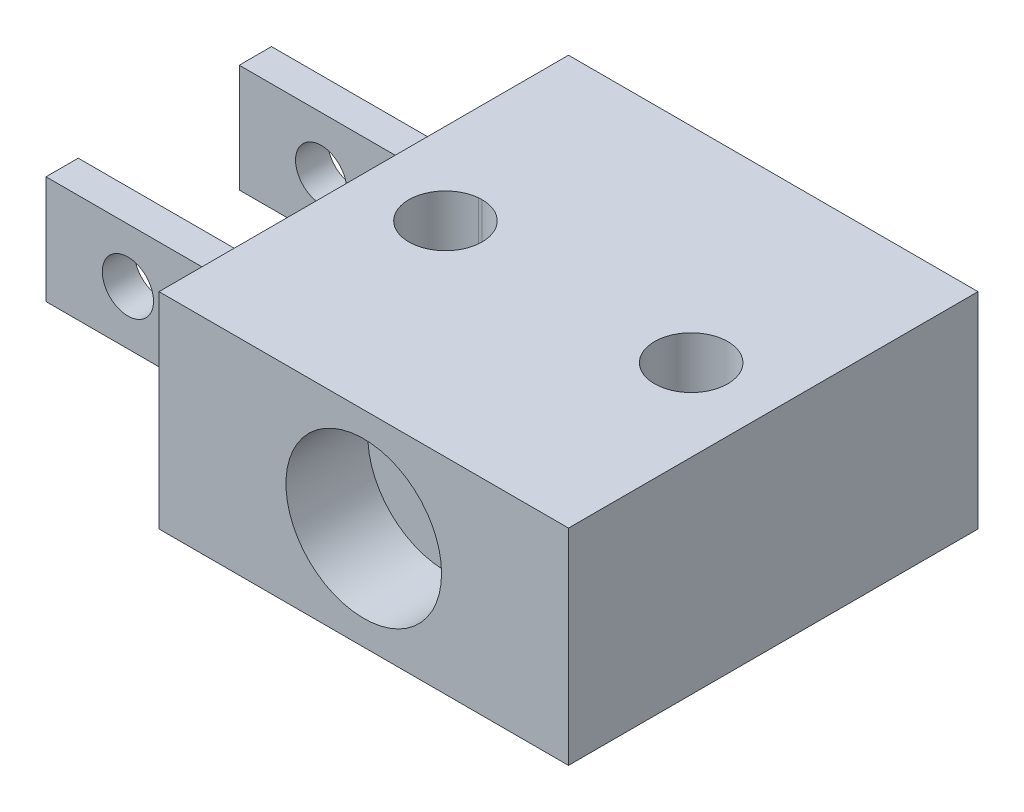
ISO-10303-21;
HEADER;
FILE_DESCRIPTION(('STEP AP214'),'2;1');
FILE_NAME('part.step','',(''),(''),'','','');
FILE_SCHEMA(('AUTOMOTIVE_DESIGN { 1 0 10303 214 1 1 1 1 }'));
ENDSEC;
DATA;
#1=APPLICATION_CONTEXT('core data for automotive mechanical design processes');
#2=APPLICATION_PROTOCOL_DEFINITION('international standard','automotive_design',2000,#1);
#3=PRODUCT_CONTEXT('',#1,'mechanical');
#4=PRODUCT('Part','Part','',(#3));
#5=PRODUCT_RELATED_PRODUCT_CATEGORY('part','',(#4));
#6=PRODUCT_DEFINITION_FORMATION('','',#4);
#7=PRODUCT_DEFINITION_CONTEXT('part definition',#1,'design');
#8=PRODUCT_DEFINITION('design','',#6,#7);
#9=PRODUCT_DEFINITION_SHAPE('','',#8);
#10=(LENGTH_UNIT() NAMED_UNIT(*) SI_UNIT(.MILLI.,.METRE.));
#11=(NAMED_UNIT(*) PLANE_ANGLE_UNIT() SI_UNIT($,.RADIAN.));
#12=(NAMED_UNIT(*) SI_UNIT($,.STERADIAN.) SOLID_ANGLE_UNIT());
#13=UNCERTAINTY_MEASURE_WITH_UNIT(LENGTH_MEASURE(1.E-05),#10,'distance_accuracy_value','');
#14=(GEOMETRIC_REPRESENTATION_CONTEXT(3) GLOBAL_UNCERTAINTY_ASSIGNED_CONTEXT((#13)) GLOBAL_UNIT_ASSIGNED_CONTEXT((#10,
#11,#12)) REPRESENTATION_CONTEXT('',''));
#15=CARTESIAN_POINT('',(0.,0.,0.));
#16=DIRECTION('',(0.,0.,1.));
#17=DIRECTION('',(1.,0.,0.));
#18=AXIS2_PLACEMENT_3D('',#15,#16,#17);
#19=CARTESIAN_POINT('',(-6.381876663172,-2.7686,-4.460010977484));
#20=DIRECTION('',(-1.,0.,0.));
#21=DIRECTION('',(0.,0.,1.));
#22=AXIS2_PLACEMENT_3D('',#19,#20,#21);
#23=PLANE('',#22);
#24=DIRECTION('',(0.,1.,0.));
#25=VECTOR('',#24,1.);
#26=CARTESIAN_POINT('',(-6.381876663172,-2.7686,8.239989022516));
#27=LINE('',#26,#25);
#28=CARTESIAN_POINT('',(-6.381876663172,-2.7686,8.239989022516));
#29=VERTEX_POINT('',#28);
#30=CARTESIAN_POINT('',(-6.381876663172,3.6068,8.239989022516));
#31=VERTEX_POINT('',#30);
#32=EDGE_CURVE('E299',#29,#31,#27,.T.);
#33=ORIENTED_EDGE('',*,*,#32,.T.);
#34=DIRECTION('',(0.,0.,1.));
#35=VECTOR('',#34,1.);
#36=CARTESIAN_POINT('',(-6.381876663172,3.6068,-4.460010977484));
#37=LINE('',#36,#35);
#38=CARTESIAN_POINT('',(-6.381876663172,3.6068,-4.460010977484));
#39=VERTEX_POINT('',#38);
#40=EDGE_CURVE('E276',#39,#31,#37,.T.);
#41=ORIENTED_EDGE('',*,*,#40,.F.);
#42=DIRECTION('',(0.,1.,0.));
#43=VECTOR('',#42,1.);
#44=CARTESIAN_POINT('',(-6.381876663172,-2.7686,-4.460010977484));
#45=LINE('',#44,#43);
#46=CARTESIAN_POINT('',(-6.381876663172,-2.7686,-4.460010977484));
#47=VERTEX_POINT('',#46);
#48=EDGE_CURVE('E11',#47,#39,#45,.T.);
#49=ORIENTED_EDGE('',*,*,#48,.F.);
#50=DIRECTION('',(0.,0.,1.));
#51=VECTOR('',#50,1.);
#52=CARTESIAN_POINT('',(-6.381876663172,-2.7686,-4.460010977484));
#53=LINE('',#52,#51);
#54=EDGE_CURVE('E288',#47,#29,#53,.T.);
#55=ORIENTED_EDGE('',*,*,#54,.T.);
#56=EDGE_LOOP('',(#33,#41,#49,#55));
#57=FACE_BOUND('',#56,.T.);
#58=DIRECTION('',(0.,0.,1.));
#59=VECTOR('',#58,1.);
#60=CARTESIAN_POINT('',(-6.381876663172,-1.258551646474,-1.598810977484));
#61=LINE('',#60,#59);
#62=CARTESIAN_POINT('',(-6.381876663172,-1.258551646474,-1.598810977484));
#63=VERTEX_POINT('',#62);
#64=CARTESIAN_POINT('',(-6.381876663172,-1.258551646474,-0.598810970884001));
#65=VERTEX_POINT('',#64);
#66=EDGE_CURVE('E261',#63,#65,#61,.T.);
#67=ORIENTED_EDGE('',*,*,#66,.F.);
#68=DIRECTION('',(0.,-1.,0.));
#69=VECTOR('',#68,1.);
#70=CARTESIAN_POINT('',(-6.381876663172,2.094248354542,-1.598810977484));
#71=LINE('',#70,#69);
#72=CARTESIAN_POINT('',(-6.381876663172,2.094248354542,-1.598810977484));
#73=VERTEX_POINT('',#72);
#74=EDGE_CURVE('E240',#73,#63,#71,.T.);
#75=ORIENTED_EDGE('',*,*,#74,.F.);
#76=DIRECTION('',(0.,0.,-1.));
#77=VECTOR('',#76,1.);
#78=CARTESIAN_POINT('',(-6.381876663172,2.094248354542,-1.598810977484));
#79=LINE('',#78,#77);
#80=CARTESIAN_POINT('',(-6.381876663172,2.094248354542,-0.598810970884));
#81=VERTEX_POINT('',#80);
#82=EDGE_CURVE('E252',#81,#73,#79,.T.);
#83=ORIENTED_EDGE('',*,*,#82,.F.);
#84=DIRECTION('',(0.,1.,0.));
#85=VECTOR('',#84,1.);
#86=CARTESIAN_POINT('',(-6.381876663172,2.094248354542,-0.598810970884001));
#87=LINE('',#86,#85);
#88=EDGE_CURVE('E263',#65,#81,#87,.T.);
#89=ORIENTED_EDGE('',*,*,#88,.F.);
#90=EDGE_LOOP('',(#67,#75,#83,#89));
#91=FACE_BOUND('',#90,.T.);
#92=DIRECTION('',(0.,0.,1.));
#93=VECTOR('',#92,1.);
#94=CARTESIAN_POINT('',(-6.381876663172,-1.258551646474,4.394789022516));
#95=LINE('',#94,#93);
#96=CARTESIAN_POINT('',(-6.381876663172,-1.258551646474,4.394789022516));
#97=VERTEX_POINT('',#96);
#98=CARTESIAN_POINT('',(-6.381876663172,-1.258551646474,5.394789029116));
#99=VERTEX_POINT('',#98);
#100=EDGE_CURVE('E235',#97,#99,#95,.T.);
#101=ORIENTED_EDGE('',*,*,#100,.F.);
#102=DIRECTION('',(0.,-1.,0.));
#103=VECTOR('',#102,1.);
#104=CARTESIAN_POINT('',(-6.381876663172,2.094248354542,4.394789022516));
#105=LINE('',#104,#103);
#106=CARTESIAN_POINT('',(-6.381876663172,2.094248354542,4.394789022516));
#107=VERTEX_POINT('',#106);
#108=EDGE_CURVE('E237',#107,#97,#105,.T.);
#109=ORIENTED_EDGE('',*,*,#108,.F.);
#110=DIRECTION('',(0.,0.,-1.));
#111=VECTOR('',#110,1.);
#112=CARTESIAN_POINT('',(-6.381876663172,2.094248354542,4.394789022516));
#113=LINE('',#112,#111);
#114=CARTESIAN_POINT('',(-6.381876663172,2.094248354542,5.394789029116));
#115=VERTEX_POINT('',#114);
#116=EDGE_CURVE('E229',#115,#107,#113,.T.);
#117=ORIENTED_EDGE('',*,*,#116,.F.);
#118=DIRECTION('',(0.,1.,0.));
#119=VECTOR('',#118,1.);
#120=CARTESIAN_POINT('',(-6.381876663172,2.094248354542,5.394789029116));
#121=LINE('',#120,#119);
#122=EDGE_CURVE('E231',#99,#115,#121,.T.);
#123=ORIENTED_EDGE('',*,*,#122,.F.);
#124=EDGE_LOOP('',(#101,#109,#117,#123));
#125=FACE_BOUND('',#124,.T.);
#126=ADVANCED_FACE('F41',(#57,#91,#125),#23,.T.);
#127=CARTESIAN_POINT('',(-6.381876663172,-2.7686,-4.460010977484));
#128=DIRECTION('',(0.,0.,-1.));
#129=DIRECTION('',(-1.,0.,0.));
#130=AXIS2_PLACEMENT_3D('',#127,#128,#129);
#131=PLANE('',#130);
#132=ORIENTED_EDGE('',*,*,#48,.T.);
#133=DIRECTION('',(-1.,0.,0.));
#134=VECTOR('',#133,1.);
#135=CARTESIAN_POINT('',(-6.381876663172,3.6068,-4.460010977484));
#136=LINE('',#135,#134);
#137=CARTESIAN_POINT('',(6.318123336828,3.6068,-4.460010977484));
#138=VERTEX_POINT('',#137);
#139=EDGE_CURVE('E285',#138,#39,#136,.T.);
#140=ORIENTED_EDGE('',*,*,#139,.F.);
#141=DIRECTION('',(0.,1.,0.));
#142=VECTOR('',#141,1.);
#143=CARTESIAN_POINT('',(6.318123336828,-2.7686,-4.460010977484));
#144=LINE('',#143,#142);
#145=CARTESIAN_POINT('',(6.318123336828,-2.7686,-4.460010977484));
#146=VERTEX_POINT('',#145);
#147=EDGE_CURVE('E51',#146,#138,#144,.T.);
#148=ORIENTED_EDGE('',*,*,#147,.F.);
#149=DIRECTION('',(-1.,0.,0.));
#150=VECTOR('',#149,1.);
#151=CARTESIAN_POINT('',(-6.381876663172,-2.7686,-4.460010977484));
#152=LINE('',#151,#150);
#153=EDGE_CURVE('E297',#146,#47,#152,.T.);
#154=ORIENTED_EDGE('',*,*,#153,.T.);
#155=EDGE_LOOP('',(#132,#140,#148,#154));
#156=FACE_BOUND('',#155,.T.);
#157=ADVANCED_FACE('F325',(#156),#131,.T.);
#158=CARTESIAN_POINT('',(6.318123336828,-2.7686,-4.460010977484));
#159=DIRECTION('',(1.,0.,0.));
#160=DIRECTION('',(0.,0.,-1.));
#161=AXIS2_PLACEMENT_3D('',#158,#159,#160);
#162=PLANE('',#161);
#163=ORIENTED_EDGE('',*,*,#147,.T.);
#164=DIRECTION('',(0.,0.,-1.));
#165=VECTOR('',#164,1.);
#166=CARTESIAN_POINT('',(6.318123336828,3.6068,-4.460010977484));
#167=LINE('',#166,#165);
#168=CARTESIAN_POINT('',(6.318123336828,3.6068,8.239989022516));
#169=VERTEX_POINT('',#168);
#170=EDGE_CURVE('E282',#169,#138,#167,.T.);
#171=ORIENTED_EDGE('',*,*,#170,.F.);
#172=DIRECTION('',(0.,1.,0.));
#173=VECTOR('',#172,1.);
#174=CARTESIAN_POINT('',(6.318123336828,-2.7686,8.239989022516));
#175=LINE('',#174,#173);
#176=CARTESIAN_POINT('',(6.318123336828,-2.7686,8.239989022516));
#177=VERTEX_POINT('',#176);
#178=EDGE_CURVE('E302',#177,#169,#175,.T.);
#179=ORIENTED_EDGE('',*,*,#178,.F.);
#180=DIRECTION('',(0.,0.,-1.));
#181=VECTOR('',#180,1.);
#182=CARTESIAN_POINT('',(6.318123336828,-2.7686,-4.460010977484));
#183=LINE('',#182,#181);
#184=EDGE_CURVE('E294',#177,#146,#183,.T.);
#185=ORIENTED_EDGE('',*,*,#184,.T.);
#186=EDGE_LOOP('',(#163,#171,#179,#185));
#187=FACE_BOUND('',#186,.T.);
#188=ADVANCED_FACE('F328',(#187),#162,.T.);
#189=CARTESIAN_POINT('',(-6.381876663172,-2.7686,8.239989022516));
#190=DIRECTION('',(0.,0.,1.));
#191=DIRECTION('',(1.,0.,0.));
#192=AXIS2_PLACEMENT_3D('',#189,#190,#191);
#193=PLANE('',#192);
#194=CARTESIAN_POINT('',(-0.031876663172,0.417848354034,8.239989022516));
#195=DIRECTION('',(0.,0.,1.));
#196=DIRECTION('',(1.,0.,0.));
#197=AXIS2_PLACEMENT_3D('',#194,#195,#196);
#198=CIRCLE('',#197,2.41300000135541);
#199=CARTESIAN_POINT('',(2.38112333818341,0.417848354034,8.239989022516));
#200=VERTEX_POINT('',#199);
#201=EDGE_CURVE('E196',#200,#200,#198,.T.);
#202=ORIENTED_EDGE('',*,*,#201,.F.);
#203=EDGE_LOOP('',(#202));
#204=FACE_BOUND('',#203,.T.);
#205=ORIENTED_EDGE('',*,*,#178,.T.);
#206=DIRECTION('',(1.,0.,0.));
#207=VECTOR('',#206,1.);
#208=CARTESIAN_POINT('',(-6.381876663172,3.6068,8.239989022516));
#209=LINE('',#208,#207);
#210=EDGE_CURVE('E279',#31,#169,#209,.T.);
#211=ORIENTED_EDGE('',*,*,#210,.F.);
#212=ORIENTED_EDGE('',*,*,#32,.F.);
#213=DIRECTION('',(1.,0.,0.));
#214=VECTOR('',#213,1.);
#215=CARTESIAN_POINT('',(-6.381876663172,-2.7686,8.239989022516));
#216=LINE('',#215,#214);
#217=EDGE_CURVE('E291',#29,#177,#216,.T.);
#218=ORIENTED_EDGE('',*,*,#217,.T.);
#219=EDGE_LOOP('',(#205,#211,#212,#218));
#220=FACE_BOUND('',#219,.T.);
#221=ADVANCED_FACE('F324',(#204,#220),#193,.T.);
#222=CARTESIAN_POINT('',(0.,-2.7686,0.));
#223=DIRECTION('',(0.,1.,0.));
#224=DIRECTION('',(0.,0.,1.));
#225=AXIS2_PLACEMENT_3D('',#222,#223,#224);
#226=PLANE('',#225);
#227=CARTESIAN_POINT('',(-3.95503730808412,-2.7686,0.765337315663838));
#228=CARTESIAN_POINT('',(-3.95424719922483,-2.7686,0.765263360718107));
#229=CARTESIAN_POINT('',(-3.91665064908767,-2.7686,0.761794886278313));
#230=CARTESIAN_POINT('',(-3.87886658892281,-2.7686,0.76073077382576));
#231=CARTESIAN_POINT('',(-3.841876663172,-2.7686,0.759689026579999));
#232=B_SPLINE_CURVE_WITH_KNOTS('',3,(#227,#228,#229,#230,#231),.UNSPECIFIED.,.F.,.F.,(4,1,4),
(0.96805009174726,0.968721605649112,1.),.UNSPECIFIED.);
#233=CARTESIAN_POINT('',(-3.95503730808412,-2.7686,0.765337315663838));
#234=VERTEX_POINT('',#233);
#235=CARTESIAN_POINT('',(-3.841876663172,-2.7686,0.759689023870666));
#236=VERTEX_POINT('',#235);
#237=EDGE_CURVE('E143',#234,#236,#232,.T.);
#238=ORIENTED_EDGE('',*,*,#237,.F.);
#239=CARTESIAN_POINT('',(-3.84187666310434,-2.7686,1.89607107011184));
#240=DIRECTION('',(0.,1.,0.));
#241=DIRECTION('',(0.,0.,1.));
#242=AXIS2_PLACEMENT_3D('',#239,#240,#241);
#243=CIRCLE('',#242,1.13638204624117);
#244=EDGE_CURVE('E59',#234,#236,#243,.T.);
#245=ORIENTED_EDGE('',*,*,#244,.T.);
#246=EDGE_LOOP('',(#238,#245));
#247=FACE_BOUND('',#246,.T.);
#248=CARTESIAN_POINT('',(3.77812333689566,-2.7686,1.89607107011184));
#249=DIRECTION('',(0.,1.,0.));
#250=DIRECTION('',(0.,0.,1.));
#251=AXIS2_PLACEMENT_3D('',#248,#249,#250);
#252=CIRCLE('',#251,1.13638204624117);
#253=CARTESIAN_POINT('',(3.77812333689566,-2.7686,3.03245311635301));
#254=VERTEX_POINT('',#253);
#255=EDGE_CURVE('E567',#254,#254,#252,.T.);
#256=ORIENTED_EDGE('',*,*,#255,.T.);
#257=EDGE_LOOP('',(#256));
#258=FACE_BOUND('',#257,.T.);
#259=ORIENTED_EDGE('',*,*,#54,.F.);
#260=ORIENTED_EDGE('',*,*,#153,.F.);
#261=ORIENTED_EDGE('',*,*,#184,.F.);
#262=ORIENTED_EDGE('',*,*,#217,.F.);
#263=EDGE_LOOP('',(#259,#260,#261,#262));
#264=FACE_BOUND('',#263,.T.);
#265=ADVANCED_FACE('F155',(#247,#258,#264),#226,.F.);
#266=CARTESIAN_POINT('',(0.,3.6068,0.));
#267=DIRECTION('',(0.,1.,0.));
#268=DIRECTION('',(0.,0.,1.));
#269=AXIS2_PLACEMENT_3D('',#266,#267,#268);
#270=PLANE('',#269);
#271=CARTESIAN_POINT('',(-3.84187666310434,3.6068,1.89607107011184));
#272=DIRECTION('',(0.,1.,0.));
#273=DIRECTION('',(0.,0.,1.));
#274=AXIS2_PLACEMENT_3D('',#271,#272,#273);
#275=CIRCLE('',#274,1.13638204624117);
#276=CARTESIAN_POINT('',(-3.95503730808408,3.6068,0.765337315664293));
#277=VERTEX_POINT('',#276);
#278=CARTESIAN_POINT('',(-3.841876663172,3.6068,0.759689026579999));
#279=VERTEX_POINT('',#278);
#280=EDGE_CURVE('E64',#277,#279,#275,.T.);
#281=ORIENTED_EDGE('',*,*,#280,.F.);
#282=CARTESIAN_POINT('',(-3.841876663172,3.6068,0.759689026579999));
#283=CARTESIAN_POINT('',(-3.87886658892281,3.6068,0.76073077382576));
#284=CARTESIAN_POINT('',(-3.91665064908767,3.6068,0.761794886278313));
#285=CARTESIAN_POINT('',(-3.95424719922483,3.6068,0.765263360718107));
#286=CARTESIAN_POINT('',(-3.95503730808412,3.6068,0.765337315663838));
#287=B_SPLINE_CURVE_WITH_KNOTS('',3,(#282,#283,#284,#285,#286),.UNSPECIFIED.,.F.,.F.,(4,1,4),
(0.96805009174726,0.999328486098148,1.),.UNSPECIFIED.);
#288=EDGE_CURVE('E157',#277,#279,#287,.F.);
#289=ORIENTED_EDGE('',*,*,#288,.T.);
#290=EDGE_LOOP('',(#281,#289));
#291=FACE_BOUND('',#290,.T.);
#292=CARTESIAN_POINT('',(3.77812333689566,3.6068,1.89607107011184));
#293=DIRECTION('',(0.,1.,0.));
#294=DIRECTION('',(0.,0.,1.));
#295=AXIS2_PLACEMENT_3D('',#292,#293,#294);
#296=CIRCLE('',#295,1.13638204624117);
#297=CARTESIAN_POINT('',(3.77812333689566,3.6068,3.03245311635301));
#298=VERTEX_POINT('',#297);
#299=EDGE_CURVE('E570',#298,#298,#296,.T.);
#300=ORIENTED_EDGE('',*,*,#299,.F.);
#301=EDGE_LOOP('',(#300));
#302=FACE_BOUND('',#301,.T.);
#303=ORIENTED_EDGE('',*,*,#40,.T.);
#304=ORIENTED_EDGE('',*,*,#210,.T.);
#305=ORIENTED_EDGE('',*,*,#170,.T.);
#306=ORIENTED_EDGE('',*,*,#139,.T.);
#307=EDGE_LOOP('',(#303,#304,#305,#306));
#308=FACE_BOUND('',#307,.T.);
#309=ADVANCED_FACE('F310',(#291,#302,#308),#270,.T.);
#310=CARTESIAN_POINT('',(-12.731876663172,2.094248354542,-1.598810977484));
#311=DIRECTION('',(0.,0.,1.));
#312=DIRECTION('',(1.,0.,0.));
#313=AXIS2_PLACEMENT_3D('',#310,#311,#312);
#314=PLANE('',#313);
#315=CARTESIAN_POINT('',(-10.191876663172,0.417848354033999,-1.598810977484));
#316=DIRECTION('',(0.,0.,1.));
#317=DIRECTION('',(1.,0.,0.));
#318=AXIS2_PLACEMENT_3D('',#315,#316,#317);
#319=CIRCLE('',#318,0.793749999576664);
#320=CARTESIAN_POINT('',(-9.39812666359534,0.417848354033999,-1.598810977484));
#321=VERTEX_POINT('',#320);
#322=EDGE_CURVE('E215',#321,#321,#319,.T.);
#323=ORIENTED_EDGE('',*,*,#322,.T.);
#324=EDGE_LOOP('',(#323));
#325=FACE_BOUND('',#324,.T.);
#326=ORIENTED_EDGE('',*,*,#74,.T.);
#327=DIRECTION('',(1.,0.,0.));
#328=VECTOR('',#327,1.);
#329=CARTESIAN_POINT('',(-12.731876663172,-1.258551646474,-1.598810977484));
#330=LINE('',#329,#328);
#331=CARTESIAN_POINT('',(-12.731876663172,-1.258551646474,-1.598810977484));
#332=VERTEX_POINT('',#331);
#333=EDGE_CURVE('E274',#332,#63,#330,.T.);
#334=ORIENTED_EDGE('',*,*,#333,.F.);
#335=DIRECTION('',(0.,-1.,0.));
#336=VECTOR('',#335,1.);
#337=CARTESIAN_POINT('',(-12.731876663172,2.094248354542,-1.598810977484));
#338=LINE('',#337,#336);
#339=CARTESIAN_POINT('',(-12.731876663172,2.094248354542,-1.598810977484));
#340=VERTEX_POINT('',#339);
#341=EDGE_CURVE('E248',#340,#332,#338,.T.);
#342=ORIENTED_EDGE('',*,*,#341,.F.);
#343=DIRECTION('',(1.,0.,0.));
#344=VECTOR('',#343,1.);
#345=CARTESIAN_POINT('',(-12.731876663172,2.094248354542,-1.598810977484));
#346=LINE('',#345,#344);
#347=EDGE_CURVE('E258',#340,#73,#346,.T.);
#348=ORIENTED_EDGE('',*,*,#347,.T.);
#349=EDGE_LOOP('',(#326,#334,#342,#348));
#350=FACE_BOUND('',#349,.T.);
#351=ADVANCED_FACE('F319',(#325,#350),#314,.F.);
#352=CARTESIAN_POINT('',(-12.731876663172,-1.258551646474,-1.598810977484));
#353=DIRECTION('',(0.,1.,0.));
#354=DIRECTION('',(0.,0.,1.));
#355=AXIS2_PLACEMENT_3D('',#352,#353,#354);
#356=PLANE('',#355);
#357=ORIENTED_EDGE('',*,*,#66,.T.);
#358=DIRECTION('',(1.,0.,0.));
#359=VECTOR('',#358,1.);
#360=CARTESIAN_POINT('',(-12.731876663172,-1.258551646474,-0.598810970884));
#361=LINE('',#360,#359);
#362=CARTESIAN_POINT('',(-12.731876663172,-1.258551646474,-0.598810970884));
#363=VERTEX_POINT('',#362);
#364=EDGE_CURVE('E271',#363,#65,#361,.T.);
#365=ORIENTED_EDGE('',*,*,#364,.F.);
#366=DIRECTION('',(0.,0.,1.));
#367=VECTOR('',#366,1.);
#368=CARTESIAN_POINT('',(-12.731876663172,-1.258551646474,-1.598810977484));
#369=LINE('',#368,#367);
#370=EDGE_CURVE('E251',#332,#363,#369,.T.);
#371=ORIENTED_EDGE('',*,*,#370,.F.);
#372=ORIENTED_EDGE('',*,*,#333,.T.);
#373=EDGE_LOOP('',(#357,#365,#371,#372));
#374=FACE_BOUND('',#373,.T.);
#375=ADVANCED_FACE('F395',(#374),#356,.F.);
#376=CARTESIAN_POINT('',(-12.731876663172,2.094248354542,-0.598810970884));
#377=DIRECTION('',(0.,0.,-1.));
#378=DIRECTION('',(-1.,0.,0.));
#379=AXIS2_PLACEMENT_3D('',#376,#377,#378);
#380=PLANE('',#379);
#381=CARTESIAN_POINT('',(-10.191876663172,0.417848354033999,-0.598810970884));
#382=DIRECTION('',(0.,0.,-1.));
#383=DIRECTION('',(-1.,0.,0.));
#384=AXIS2_PLACEMENT_3D('',#381,#382,#383);
#385=CIRCLE('',#384,0.793749999576664);
#386=CARTESIAN_POINT('',(-10.9856266627487,0.417848354033999,-0.598810970884));
#387=VERTEX_POINT('',#386);
#388=EDGE_CURVE('E212',#387,#387,#385,.T.);
#389=ORIENTED_EDGE('',*,*,#388,.T.);
#390=EDGE_LOOP('',(#389));
#391=FACE_BOUND('',#390,.T.);
#392=ORIENTED_EDGE('',*,*,#88,.T.);
#393=DIRECTION('',(1.,0.,0.));
#394=VECTOR('',#393,1.);
#395=CARTESIAN_POINT('',(-12.731876663172,2.094248354542,-0.598810970884));
#396=LINE('',#395,#394);
#397=CARTESIAN_POINT('',(-12.731876663172,2.094248354542,-0.598810970884));
#398=VERTEX_POINT('',#397);
#399=EDGE_CURVE('E269',#398,#81,#396,.T.);
#400=ORIENTED_EDGE('',*,*,#399,.F.);
#401=DIRECTION('',(0.,1.,0.));
#402=VECTOR('',#401,1.);
#403=CARTESIAN_POINT('',(-12.731876663172,2.094248354542,-0.598810970884));
#404=LINE('',#403,#402);
#405=EDGE_CURVE('E254',#363,#398,#404,.T.);
#406=ORIENTED_EDGE('',*,*,#405,.F.);
#407=ORIENTED_EDGE('',*,*,#364,.T.);
#408=EDGE_LOOP('',(#392,#400,#406,#407));
#409=FACE_BOUND('',#408,.T.);
#410=ADVANCED_FACE('F392',(#391,#409),#380,.F.);
#411=CARTESIAN_POINT('',(-12.731876663172,2.094248354542,-1.598810977484));
#412=DIRECTION('',(0.,-1.,0.));
#413=DIRECTION('',(0.,0.,-1.));
#414=AXIS2_PLACEMENT_3D('',#411,#412,#413);
#415=PLANE('',#414);
#416=ORIENTED_EDGE('',*,*,#82,.T.);
#417=ORIENTED_EDGE('',*,*,#347,.F.);
#418=DIRECTION('',(0.,0.,-1.));
#419=VECTOR('',#418,1.);
#420=CARTESIAN_POINT('',(-12.731876663172,2.094248354542,-1.598810977484));
#421=LINE('',#420,#419);
#422=EDGE_CURVE('E256',#398,#340,#421,.T.);
#423=ORIENTED_EDGE('',*,*,#422,.F.);
#424=ORIENTED_EDGE('',*,*,#399,.T.);
#425=EDGE_LOOP('',(#416,#417,#423,#424));
#426=FACE_BOUND('',#425,.T.);
#427=ADVANCED_FACE('F388',(#426),#415,.F.);
#428=CARTESIAN_POINT('',(-12.731876663172,0.,0.));
#429=DIRECTION('',(-1.,0.,0.));
#430=DIRECTION('',(0.,0.,1.));
#431=AXIS2_PLACEMENT_3D('',#428,#429,#430);
#432=PLANE('',#431);
#433=ORIENTED_EDGE('',*,*,#341,.T.);
#434=ORIENTED_EDGE('',*,*,#370,.T.);
#435=ORIENTED_EDGE('',*,*,#405,.T.);
#436=ORIENTED_EDGE('',*,*,#422,.T.);
#437=EDGE_LOOP('',(#433,#434,#435,#436));
#438=FACE_BOUND('',#437,.T.);
#439=ADVANCED_FACE('F385',(#438),#432,.T.);
#440=CARTESIAN_POINT('',(-12.731876663172,2.094248354542,4.394789022516));
#441=DIRECTION('',(0.,0.,1.));
#442=DIRECTION('',(1.,0.,0.));
#443=AXIS2_PLACEMENT_3D('',#440,#441,#442);
#444=PLANE('',#443);
#445=CARTESIAN_POINT('',(-10.191876663172,0.417848354033999,4.394789022516));
#446=DIRECTION('',(0.,0.,1.));
#447=DIRECTION('',(1.,0.,0.));
#448=AXIS2_PLACEMENT_3D('',#445,#446,#447);
#449=CIRCLE('',#448,0.793749999576664);
#450=CARTESIAN_POINT('',(-9.39812666359534,0.417848354033999,4.394789022516));
#451=VERTEX_POINT('',#450);
#452=EDGE_CURVE('E209',#451,#451,#449,.T.);
#453=ORIENTED_EDGE('',*,*,#452,.T.);
#454=EDGE_LOOP('',(#453));
#455=FACE_BOUND('',#454,.T.);
#456=ORIENTED_EDGE('',*,*,#108,.T.);
#457=DIRECTION('',(1.,0.,0.));
#458=VECTOR('',#457,1.);
#459=CARTESIAN_POINT('',(-12.731876663172,-1.258551646474,4.394789022516));
#460=LINE('',#459,#458);
#461=CARTESIAN_POINT('',(-12.731876663172,-1.258551646474,4.394789022516));
#462=VERTEX_POINT('',#461);
#463=EDGE_CURVE('E218',#462,#97,#460,.T.);
#464=ORIENTED_EDGE('',*,*,#463,.F.);
#465=DIRECTION('',(0.,-1.,0.));
#466=VECTOR('',#465,1.);
#467=CARTESIAN_POINT('',(-12.731876663172,2.094248354542,4.394789022516));
#468=LINE('',#467,#466);
#469=CARTESIAN_POINT('',(-12.731876663172,2.094248354542,4.394789022516));
#470=VERTEX_POINT('',#469);
#471=EDGE_CURVE('E232',#470,#462,#468,.T.);
#472=ORIENTED_EDGE('',*,*,#471,.F.);
#473=DIRECTION('',(1.,0.,0.));
#474=VECTOR('',#473,1.);
#475=CARTESIAN_POINT('',(-12.731876663172,2.094248354542,4.394789022516));
#476=LINE('',#475,#474);
#477=EDGE_CURVE('E225',#470,#107,#476,.T.);
#478=ORIENTED_EDGE('',*,*,#477,.T.);
#479=EDGE_LOOP('',(#456,#464,#472,#478));
#480=FACE_BOUND('',#479,.T.);
#481=ADVANCED_FACE('F369',(#455,#480),#444,.F.);
#482=CARTESIAN_POINT('',(-12.731876663172,-1.258551646474,4.394789022516));
#483=DIRECTION('',(0.,1.,0.));
#484=DIRECTION('',(0.,0.,1.));
#485=AXIS2_PLACEMENT_3D('',#482,#483,#484);
#486=PLANE('',#485);
#487=ORIENTED_EDGE('',*,*,#100,.T.);
#488=DIRECTION('',(1.,0.,0.));
#489=VECTOR('',#488,1.);
#490=CARTESIAN_POINT('',(-12.731876663172,-1.258551646474,5.394789029116));
#491=LINE('',#490,#489);
#492=CARTESIAN_POINT('',(-12.731876663172,-1.258551646474,5.394789029116));
#493=VERTEX_POINT('',#492);
#494=EDGE_CURVE('E220',#493,#99,#491,.T.);
#495=ORIENTED_EDGE('',*,*,#494,.F.);
#496=DIRECTION('',(0.,0.,1.));
#497=VECTOR('',#496,1.);
#498=CARTESIAN_POINT('',(-12.731876663172,-1.258551646474,4.394789022516));
#499=LINE('',#498,#497);
#500=EDGE_CURVE('E244',#462,#493,#499,.T.);
#501=ORIENTED_EDGE('',*,*,#500,.F.);
#502=ORIENTED_EDGE('',*,*,#463,.T.);
#503=EDGE_LOOP('',(#487,#495,#501,#502));
#504=FACE_BOUND('',#503,.T.);
#505=ADVANCED_FACE('F357',(#504),#486,.F.);
#506=CARTESIAN_POINT('',(-12.731876663172,2.094248354542,5.394789029116));
#507=DIRECTION('',(0.,0.,-1.));
#508=DIRECTION('',(-1.,0.,0.));
#509=AXIS2_PLACEMENT_3D('',#506,#507,#508);
#510=PLANE('',#509);
#511=CARTESIAN_POINT('',(-10.191876663172,0.417848354033999,5.394789029116));
#512=DIRECTION('',(0.,0.,1.));
#513=DIRECTION('',(1.,0.,0.));
#514=AXIS2_PLACEMENT_3D('',#511,#512,#513);
#515=CIRCLE('',#514,0.793749999576664);
#516=CARTESIAN_POINT('',(-9.39812666359534,0.417848354033999,5.394789029116));
#517=VERTEX_POINT('',#516);
#518=EDGE_CURVE('E203',#517,#517,#515,.T.);
#519=ORIENTED_EDGE('',*,*,#518,.F.);
#520=EDGE_LOOP('',(#519));
#521=FACE_BOUND('',#520,.T.);
#522=ORIENTED_EDGE('',*,*,#122,.T.);
#523=DIRECTION('',(1.,0.,0.));
#524=VECTOR('',#523,1.);
#525=CARTESIAN_POINT('',(-12.731876663172,2.094248354542,5.394789029116));
#526=LINE('',#525,#524);
#527=CARTESIAN_POINT('',(-12.731876663172,2.094248354542,5.394789029116));
#528=VERTEX_POINT('',#527);
#529=EDGE_CURVE('E223',#528,#115,#526,.T.);
#530=ORIENTED_EDGE('',*,*,#529,.F.);
#531=DIRECTION('',(0.,1.,0.));
#532=VECTOR('',#531,1.);
#533=CARTESIAN_POINT('',(-12.731876663172,2.094248354542,5.394789029116));
#534=LINE('',#533,#532);
#535=EDGE_CURVE('E242',#493,#528,#534,.T.);
#536=ORIENTED_EDGE('',*,*,#535,.F.);
#537=ORIENTED_EDGE('',*,*,#494,.T.);
#538=EDGE_LOOP('',(#522,#530,#536,#537));
#539=FACE_BOUND('',#538,.T.);
#540=ADVANCED_FACE('F361',(#521,#539),#510,.F.);
#541=CARTESIAN_POINT('',(-12.731876663172,2.094248354542,4.394789022516));
#542=DIRECTION('',(0.,-1.,0.));
#543=DIRECTION('',(0.,0.,-1.));
#544=AXIS2_PLACEMENT_3D('',#541,#542,#543);
#545=PLANE('',#544);
#546=ORIENTED_EDGE('',*,*,#116,.T.);
#547=ORIENTED_EDGE('',*,*,#477,.F.);
#548=DIRECTION('',(0.,0.,-1.));
#549=VECTOR('',#548,1.);
#550=CARTESIAN_POINT('',(-12.731876663172,2.094248354542,4.394789022516));
#551=LINE('',#550,#549);
#552=EDGE_CURVE('E228',#528,#470,#551,.T.);
#553=ORIENTED_EDGE('',*,*,#552,.F.);
#554=ORIENTED_EDGE('',*,*,#529,.T.);
#555=EDGE_LOOP('',(#546,#547,#553,#554));
#556=FACE_BOUND('',#555,.T.);
#557=ADVANCED_FACE('F371',(#556),#545,.F.);
#558=CARTESIAN_POINT('',(-12.731876663172,0.,0.));
#559=DIRECTION('',(-1.,0.,0.));
#560=DIRECTION('',(0.,0.,1.));
#561=AXIS2_PLACEMENT_3D('',#558,#559,#560);
#562=PLANE('',#561);
#563=ORIENTED_EDGE('',*,*,#471,.T.);
#564=ORIENTED_EDGE('',*,*,#500,.T.);
#565=ORIENTED_EDGE('',*,*,#535,.T.);
#566=ORIENTED_EDGE('',*,*,#552,.T.);
#567=EDGE_LOOP('',(#563,#564,#565,#566));
#568=FACE_BOUND('',#567,.T.);
#569=ADVANCED_FACE('F365',(#568),#562,.T.);
#570=CARTESIAN_POINT('',(-10.191876663172,0.417848354033999,-4.460010977484));
#571=DIRECTION('',(0.,0.,1.));
#572=DIRECTION('',(1.,0.,0.));
#573=AXIS2_PLACEMENT_3D('',#570,#571,#572);
#574=CYLINDRICAL_SURFACE('',#573,0.793749999576664);
#575=ORIENTED_EDGE('',*,*,#518,.T.);
#576=EDGE_LOOP('',(#575));
#577=FACE_BOUND('',#576,.T.);
#578=ORIENTED_EDGE('',*,*,#452,.F.);
#579=EDGE_LOOP('',(#578));
#580=FACE_BOUND('',#579,.T.);
#581=ADVANCED_FACE('F378',(#577,#580),#574,.F.);
#582=ORIENTED_EDGE('',*,*,#388,.F.);
#583=EDGE_LOOP('',(#582));
#584=FACE_BOUND('',#583,.T.);
#585=ORIENTED_EDGE('',*,*,#322,.F.);
#586=EDGE_LOOP('',(#585));
#587=FACE_BOUND('',#586,.T.);
#588=ADVANCED_FACE('F416',(#584,#587),#574,.F.);
#589=CARTESIAN_POINT('',(-0.031876663172,0.417848354034,5.699989022516));
#590=DIRECTION('',(0.,0.,1.));
#591=DIRECTION('',(1.,0.,0.));
#592=AXIS2_PLACEMENT_3D('',#589,#590,#591);
#593=CYLINDRICAL_SURFACE('',#592,2.41300000135541);
#594=CARTESIAN_POINT('',(-0.031876663172,0.417848354034,5.699989022516));
#595=DIRECTION('',(0.,0.,1.));
#596=DIRECTION('',(1.,0.,0.));
#597=AXIS2_PLACEMENT_3D('',#594,#595,#596);
#598=CIRCLE('',#597,2.41300000135541);
#599=CARTESIAN_POINT('',(2.38112333818341,0.417848354034,5.699989022516));
#600=VERTEX_POINT('',#599);
#601=EDGE_CURVE('E198',#600,#600,#598,.T.);
#602=ORIENTED_EDGE('',*,*,#601,.F.);
#603=EDGE_LOOP('',(#602));
#604=FACE_BOUND('',#603,.T.);
#605=ORIENTED_EDGE('',*,*,#201,.T.);
#606=EDGE_LOOP('',(#605));
#607=FACE_BOUND('',#606,.T.);
#608=ADVANCED_FACE('F417',(#604,#607),#593,.F.);
#609=CARTESIAN_POINT('',(-0.031876663172,0.417848354034,5.699989022516));
#610=DIRECTION('',(0.,0.,1.));
#611=DIRECTION('',(1.,0.,0.));
#612=AXIS2_PLACEMENT_3D('',#609,#610,#611);
#613=PLANE('',#612);
#614=ORIENTED_EDGE('',*,*,#601,.T.);
#615=EDGE_LOOP('',(#614));
#616=FACE_BOUND('',#615,.T.);
#617=ADVANCED_FACE('F423',(#616),#613,.T.);
#618=CARTESIAN_POINT('',(3.77812333689566,-2.7686,1.89607107011184));
#619=DIRECTION('',(0.,1.,0.));
#620=DIRECTION('',(0.,0.,1.));
#621=AXIS2_PLACEMENT_3D('',#618,#619,#620);
#622=CYLINDRICAL_SURFACE('',#621,1.13638204624117);
#623=ORIENTED_EDGE('',*,*,#255,.F.);
#624=EDGE_LOOP('',(#623));
#625=FACE_BOUND('',#624,.T.);
#626=ORIENTED_EDGE('',*,*,#299,.T.);
#627=EDGE_LOOP('',(#626));
#628=FACE_BOUND('',#627,.T.);
#629=ADVANCED_FACE('F500',(#625,#628),#622,.F.);
#630=CARTESIAN_POINT('',(-3.84187666310434,-2.7686,1.89607107011184));
#631=DIRECTION('',(0.,1.,0.));
#632=DIRECTION('',(0.,0.,1.));
#633=AXIS2_PLACEMENT_3D('',#630,#631,#632);
#634=CYLINDRICAL_SURFACE('',#633,1.13638204624117);
#635=ORIENTED_EDGE('',*,*,#280,.T.);
#636=DIRECTION('',(0.,1.,0.));
#637=VECTOR('',#636,1.);
#638=CARTESIAN_POINT('',(-3.841876663172,-2.7686,0.759689023870666));
#639=LINE('',#638,#637);
#640=EDGE_CURVE('E147',#236,#279,#639,.T.);
#641=ORIENTED_EDGE('',*,*,#640,.F.);
#642=ORIENTED_EDGE('',*,*,#244,.F.);
#643=DIRECTION('',(0.,1.,0.));
#644=VECTOR('',#643,1.);
#645=CARTESIAN_POINT('',(-3.95503730808408,-2.7686,0.765337315664293));
#646=LINE('',#645,#644);
#647=EDGE_CURVE('E149',#234,#277,#646,.T.);
#648=ORIENTED_EDGE('',*,*,#647,.T.);
#649=EDGE_LOOP('',(#635,#641,#642,#648));
#650=FACE_BOUND('',#649,.T.);
#651=ADVANCED_FACE('F153',(#650),#634,.F.);
#652=CARTESIAN_POINT('',(-3.841876663172,-2.7686,3.020289018452));
#653=CARTESIAN_POINT('',(-3.87886658892281,-2.7686,3.01924727120624));
#654=CARTESIAN_POINT('',(-3.95284644037275,-2.7686,3.01716377671617));
#655=CARTESIAN_POINT('',(-4.0627379502464,-2.7686,3.00021240098146));
#656=CARTESIAN_POINT('',(-4.17052529641498,-2.7686,2.97341039391665));
#657=CARTESIAN_POINT('',(-4.3098690537111,-2.7686,2.92347175783042));
#658=CARTESIAN_POINT('',(-4.47391356628218,-2.7686,2.83586083319281));
#659=CARTESIAN_POINT('',(-4.64626405026473,-2.7686,2.69438294867849));
#660=CARTESIAN_POINT('',(-4.78774696786127,-2.7686,2.52199826335979));
#661=CARTESIAN_POINT('',(-4.89286867089496,-2.7686,2.32532432146031));
#662=CARTESIAN_POINT('',(-4.9576045599974,-2.7686,2.11192108563028));
#663=CARTESIAN_POINT('',(-4.97946270884869,-2.7686,1.889989022516));
#664=CARTESIAN_POINT('',(-4.9576045599974,-2.7686,1.66805695940171));
#665=CARTESIAN_POINT('',(-4.89286867089496,-2.7686,1.45465372357169));
#666=CARTESIAN_POINT('',(-4.78774696786127,-2.7686,1.25797978167221));
#667=CARTESIAN_POINT('',(-4.64626405026473,-2.7686,1.08559509635351));
#668=CARTESIAN_POINT('',(-4.47391356628218,-2.7686,0.944117211839188));
#669=CARTESIAN_POINT('',(-4.3098690537111,-2.7686,0.856506287201577));
#670=CARTESIAN_POINT('',(-4.17052529641498,-2.7686,0.806567651115352));
#671=CARTESIAN_POINT('',(-4.0627379502464,-2.7686,0.779765644050544));
#672=CARTESIAN_POINT('',(-3.95284644037275,-2.7686,0.762814268315828));
#673=CARTESIAN_POINT('',(-3.87886658892281,-2.7686,0.76073077382576));
#674=CARTESIAN_POINT('',(-3.841876663172,-2.7686,0.759689026579999));
#675=B_SPLINE_CURVE_WITH_KNOTS('',3,(#652,#653,#654,#655,#656,#657,#658,#659,#660,#661,#662,
#663,#664,#665,#666,#667,#668,#669,#670,#671,#672,#673,#674),.UNSPECIFIED.,.F.,.F.,(4,1,1,1,1,1,
1,1,1,1,1,1,1,1,1,1,1,1,1,1,4),(0.,0.0312783943508874,0.062556788658078,0.0938351808317352,
0.125113574108662,0.187594644983034,0.250075716697702,0.312556788412369,0.375037859286742,
0.437518928053578,0.5,0.562481071946422,0.624962140713258,0.687443211587631,0.749924283302298,
0.812405355016966,0.874886425891338,0.906164819168264,0.937443211341922,0.968721605649112,1.),.UNSPECIFIED.);
#676=DIRECTION('',(0.,1.,0.));
#677=VECTOR('',#676,1.);
#678=SURFACE_OF_LINEAR_EXTRUSION('',#675,#677);
#679=ORIENTED_EDGE('',*,*,#288,.F.);
#680=ORIENTED_EDGE('',*,*,#647,.F.);
#681=ORIENTED_EDGE('',*,*,#237,.T.);
#682=ORIENTED_EDGE('',*,*,#640,.T.);
#683=EDGE_LOOP('',(#679,#680,#681,#682));
#684=FACE_BOUND('',#683,.T.);
#685=ADVANCED_FACE('F146',(#684),#678,.T.);
#686=CLOSED_SHELL('',(#126,#157,#188,#221,#265,#309,#351,#375,#410,#427,#439,#481,#505,#540,
#557,#569,#581,#588,#608,#617,#629,#651,#685));
#687=MANIFOLD_SOLID_BREP('B2',#686);
#688=ADVANCED_BREP_SHAPE_REPRESENTATION('',(#18,#687),#14);
#689=SHAPE_DEFINITION_REPRESENTATION(#9,#688);
ENDSEC;
END-ISO-10303-21;
